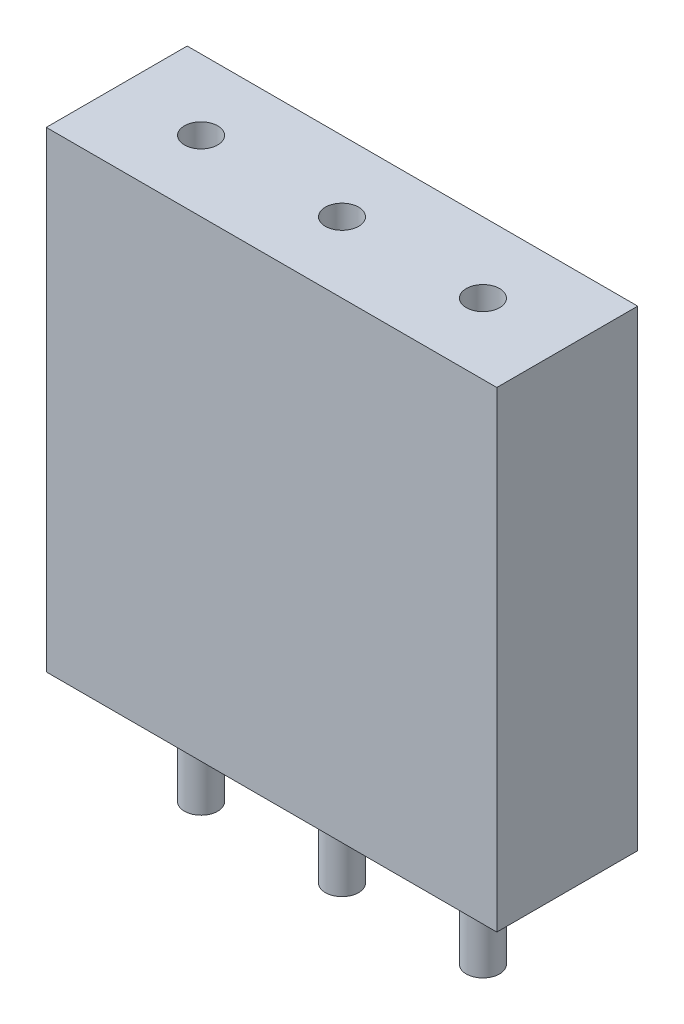
ISO-10303-21;
HEADER;
FILE_DESCRIPTION(('STEP AP214'),'2;1');
FILE_NAME('part.step','',(''),(''),'','','');
FILE_SCHEMA(('AUTOMOTIVE_DESIGN { 1 0 10303 214 1 1 1 1 }'));
ENDSEC;
DATA;
#1=APPLICATION_CONTEXT('core data for automotive mechanical design processes');
#2=APPLICATION_PROTOCOL_DEFINITION('international standard','automotive_design',2000,#1);
#3=PRODUCT_CONTEXT('',#1,'mechanical');
#4=PRODUCT('Part','Part','',(#3));
#5=PRODUCT_RELATED_PRODUCT_CATEGORY('part','',(#4));
#6=PRODUCT_DEFINITION_FORMATION('','',#4);
#7=PRODUCT_DEFINITION_CONTEXT('part definition',#1,'design');
#8=PRODUCT_DEFINITION('design','',#6,#7);
#9=PRODUCT_DEFINITION_SHAPE('','',#8);
#10=(LENGTH_UNIT() NAMED_UNIT(*) SI_UNIT(.MILLI.,.METRE.));
#11=(NAMED_UNIT(*) PLANE_ANGLE_UNIT() SI_UNIT($,.RADIAN.));
#12=(NAMED_UNIT(*) SI_UNIT($,.STERADIAN.) SOLID_ANGLE_UNIT());
#13=UNCERTAINTY_MEASURE_WITH_UNIT(LENGTH_MEASURE(1.E-05),#10,'distance_accuracy_value','');
#14=(GEOMETRIC_REPRESENTATION_CONTEXT(3) GLOBAL_UNCERTAINTY_ASSIGNED_CONTEXT((#13)) GLOBAL_UNIT_ASSIGNED_CONTEXT((#10,
#11,#12)) REPRESENTATION_CONTEXT('',''));
#15=CARTESIAN_POINT('',(0.,0.,0.));
#16=DIRECTION('',(0.,0.,1.));
#17=DIRECTION('',(1.,0.,0.));
#18=AXIS2_PLACEMENT_3D('',#15,#16,#17);
#19=CARTESIAN_POINT('',(2.53999999999998,-1.9,0.));
#20=DIRECTION('',(0.,1.,0.));
#21=DIRECTION('',(0.,0.,1.));
#22=AXIS2_PLACEMENT_3D('',#19,#20,#21);
#23=CYLINDRICAL_SURFACE('',#22,0.3);
#24=CARTESIAN_POINT('',(2.53999999999998,-1.9,0.));
#25=DIRECTION('',(0.,-1.,0.));
#26=DIRECTION('',(0.,0.,-1.));
#27=AXIS2_PLACEMENT_3D('',#24,#25,#26);
#28=CIRCLE('',#27,0.3);
#29=CARTESIAN_POINT('',(2.53999999999998,-1.9,-0.3));
#30=VERTEX_POINT('',#29);
#31=EDGE_CURVE('E11',#30,#30,#28,.T.);
#32=ORIENTED_EDGE('',*,*,#31,.F.);
#33=EDGE_LOOP('',(#32));
#34=FACE_BOUND('',#33,.T.);
#35=CARTESIAN_POINT('',(2.53999999999998,0.,0.));
#36=DIRECTION('',(0.,-1.,0.));
#37=DIRECTION('',(0.,0.,-1.));
#38=AXIS2_PLACEMENT_3D('',#35,#36,#37);
#39=CIRCLE('',#38,0.3);
#40=CARTESIAN_POINT('',(2.53999999999998,0.,-0.3));
#41=VERTEX_POINT('',#40);
#42=EDGE_CURVE('E45',#41,#41,#39,.T.);
#43=ORIENTED_EDGE('',*,*,#42,.T.);
#44=EDGE_LOOP('',(#43));
#45=FACE_BOUND('',#44,.T.);
#46=ADVANCED_FACE('F42',(#34,#45),#23,.T.);
#47=CARTESIAN_POINT('',(2.53999999999998,-1.9,0.));
#48=DIRECTION('',(0.,-1.,0.));
#49=DIRECTION('',(0.,0.,-1.));
#50=AXIS2_PLACEMENT_3D('',#47,#48,#49);
#51=PLANE('',#50);
#52=ORIENTED_EDGE('',*,*,#31,.T.);
#53=EDGE_LOOP('',(#52));
#54=FACE_BOUND('',#53,.T.);
#55=ADVANCED_FACE('F57',(#54),#51,.T.);
#56=CARTESIAN_POINT('',(2.53999999999998,0.,0.));
#57=DIRECTION('',(0.,-1.,0.));
#58=DIRECTION('',(0.,0.,-1.));
#59=AXIS2_PLACEMENT_3D('',#56,#57,#58);
#60=PLANE('',#59);
#61=ORIENTED_EDGE('',*,*,#42,.F.);
#62=EDGE_LOOP('',(#61));
#63=FACE_BOUND('',#62,.T.);
#64=ADVANCED_FACE('F55',(#63),#60,.F.);
#65=CLOSED_SHELL('',(#46,#55,#64));
#66=MANIFOLD_SOLID_BREP('B2',#65);
#67=CARTESIAN_POINT('',(0.,-1.9,0.));
#68=DIRECTION('',(0.,1.,0.));
#69=DIRECTION('',(0.,0.,1.));
#70=AXIS2_PLACEMENT_3D('',#67,#68,#69);
#71=CYLINDRICAL_SURFACE('',#70,0.3);
#72=CARTESIAN_POINT('',(0.,-1.9,0.));
#73=DIRECTION('',(0.,-1.,0.));
#74=DIRECTION('',(0.,0.,-1.));
#75=AXIS2_PLACEMENT_3D('',#72,#73,#74);
#76=CIRCLE('',#75,0.3);
#77=CARTESIAN_POINT('',(0.,-1.9,-0.3));
#78=VERTEX_POINT('',#77);
#79=EDGE_CURVE('E41',#78,#78,#76,.T.);
#80=ORIENTED_EDGE('',*,*,#79,.F.);
#81=EDGE_LOOP('',(#80));
#82=FACE_BOUND('',#81,.T.);
#83=CARTESIAN_POINT('',(0.,0.,0.));
#84=DIRECTION('',(0.,-1.,0.));
#85=DIRECTION('',(0.,0.,-1.));
#86=AXIS2_PLACEMENT_3D('',#83,#84,#85);
#87=CIRCLE('',#86,0.3);
#88=CARTESIAN_POINT('',(0.,0.,-0.3));
#89=VERTEX_POINT('',#88);
#90=EDGE_CURVE('E94',#89,#89,#87,.T.);
#91=ORIENTED_EDGE('',*,*,#90,.T.);
#92=EDGE_LOOP('',(#91));
#93=FACE_BOUND('',#92,.T.);
#94=ADVANCED_FACE('F91',(#82,#93),#71,.T.);
#95=CARTESIAN_POINT('',(0.,-1.9,0.));
#96=DIRECTION('',(0.,-1.,0.));
#97=DIRECTION('',(0.,0.,-1.));
#98=AXIS2_PLACEMENT_3D('',#95,#96,#97);
#99=PLANE('',#98);
#100=ORIENTED_EDGE('',*,*,#79,.T.);
#101=EDGE_LOOP('',(#100));
#102=FACE_BOUND('',#101,.T.);
#103=ADVANCED_FACE('F106',(#102),#99,.T.);
#104=CARTESIAN_POINT('',(0.,0.,0.));
#105=DIRECTION('',(0.,-1.,0.));
#106=DIRECTION('',(0.,0.,-1.));
#107=AXIS2_PLACEMENT_3D('',#104,#105,#106);
#108=PLANE('',#107);
#109=ORIENTED_EDGE('',*,*,#90,.F.);
#110=EDGE_LOOP('',(#109));
#111=FACE_BOUND('',#110,.T.);
#112=ADVANCED_FACE('F104',(#111),#108,.F.);
#113=CLOSED_SHELL('',(#94,#103,#112));
#114=MANIFOLD_SOLID_BREP('B6',#113);
#115=CARTESIAN_POINT('',(-2.54000000000002,-1.9,0.));
#116=DIRECTION('',(0.,1.,0.));
#117=DIRECTION('',(0.,0.,1.));
#118=AXIS2_PLACEMENT_3D('',#115,#116,#117);
#119=CYLINDRICAL_SURFACE('',#118,0.3);
#120=CARTESIAN_POINT('',(-2.54000000000002,-1.9,0.));
#121=DIRECTION('',(0.,-1.,0.));
#122=DIRECTION('',(0.,0.,-1.));
#123=AXIS2_PLACEMENT_3D('',#120,#121,#122);
#124=CIRCLE('',#123,0.3);
#125=CARTESIAN_POINT('',(-2.54000000000002,-1.9,-0.3));
#126=VERTEX_POINT('',#125);
#127=EDGE_CURVE('E90',#126,#126,#124,.T.);
#128=ORIENTED_EDGE('',*,*,#127,.F.);
#129=EDGE_LOOP('',(#128));
#130=FACE_BOUND('',#129,.T.);
#131=CARTESIAN_POINT('',(-2.54000000000002,0.,0.));
#132=DIRECTION('',(0.,-1.,0.));
#133=DIRECTION('',(0.,0.,-1.));
#134=AXIS2_PLACEMENT_3D('',#131,#132,#133);
#135=CIRCLE('',#134,0.3);
#136=CARTESIAN_POINT('',(-2.54000000000002,0.,-0.3));
#137=VERTEX_POINT('',#136);
#138=EDGE_CURVE('E144',#137,#137,#135,.T.);
#139=ORIENTED_EDGE('',*,*,#138,.T.);
#140=EDGE_LOOP('',(#139));
#141=FACE_BOUND('',#140,.T.);
#142=ADVANCED_FACE('F141',(#130,#141),#119,.T.);
#143=CARTESIAN_POINT('',(-2.54000000000002,-1.9,0.));
#144=DIRECTION('',(0.,-1.,0.));
#145=DIRECTION('',(0.,0.,-1.));
#146=AXIS2_PLACEMENT_3D('',#143,#144,#145);
#147=PLANE('',#146);
#148=ORIENTED_EDGE('',*,*,#127,.T.);
#149=EDGE_LOOP('',(#148));
#150=FACE_BOUND('',#149,.T.);
#151=ADVANCED_FACE('F156',(#150),#147,.T.);
#152=CARTESIAN_POINT('',(-2.54000000000002,0.,0.));
#153=DIRECTION('',(0.,-1.,0.));
#154=DIRECTION('',(0.,0.,-1.));
#155=AXIS2_PLACEMENT_3D('',#152,#153,#154);
#156=PLANE('',#155);
#157=ORIENTED_EDGE('',*,*,#138,.F.);
#158=EDGE_LOOP('',(#157));
#159=FACE_BOUND('',#158,.T.);
#160=ADVANCED_FACE('F154',(#159),#156,.F.);
#161=CLOSED_SHELL('',(#142,#151,#160));
#162=MANIFOLD_SOLID_BREP('B36',#161);
#163=CARTESIAN_POINT('',(4.06,8.5,-1.27));
#164=DIRECTION('',(-1.,0.,0.));
#165=DIRECTION('',(0.,0.,1.));
#166=AXIS2_PLACEMENT_3D('',#163,#164,#165);
#167=PLANE('',#166);
#168=DIRECTION('',(0.,0.,-1.));
#169=VECTOR('',#168,1.);
#170=CARTESIAN_POINT('',(4.06,0.,-1.27));
#171=LINE('',#170,#169);
#172=CARTESIAN_POINT('',(4.06,0.,1.27));
#173=VERTEX_POINT('',#172);
#174=CARTESIAN_POINT('',(4.06,0.,-1.27));
#175=VERTEX_POINT('',#174);
#176=EDGE_CURVE('E245',#173,#175,#171,.T.);
#177=ORIENTED_EDGE('',*,*,#176,.T.);
#178=DIRECTION('',(0.,-1.,0.));
#179=VECTOR('',#178,1.);
#180=CARTESIAN_POINT('',(4.06,8.5,-1.27));
#181=LINE('',#180,#179);
#182=CARTESIAN_POINT('',(4.06,8.5,-1.27));
#183=VERTEX_POINT('',#182);
#184=EDGE_CURVE('E139',#183,#175,#181,.T.);
#185=ORIENTED_EDGE('',*,*,#184,.F.);
#186=DIRECTION('',(0.,0.,-1.));
#187=VECTOR('',#186,1.);
#188=CARTESIAN_POINT('',(4.06,8.5,-1.27));
#189=LINE('',#188,#187);
#190=CARTESIAN_POINT('',(4.06,8.5,1.27));
#191=VERTEX_POINT('',#190);
#192=EDGE_CURVE('E233',#191,#183,#189,.T.);
#193=ORIENTED_EDGE('',*,*,#192,.F.);
#194=DIRECTION('',(0.,-1.,0.));
#195=VECTOR('',#194,1.);
#196=CARTESIAN_POINT('',(4.06,8.5,1.27));
#197=LINE('',#196,#195);
#198=EDGE_CURVE('E241',#191,#173,#197,.T.);
#199=ORIENTED_EDGE('',*,*,#198,.T.);
#200=EDGE_LOOP('',(#177,#185,#193,#199));
#201=FACE_BOUND('',#200,.T.);
#202=ADVANCED_FACE('F182',(#201),#167,.F.);
#203=CARTESIAN_POINT('',(-4.06,8.5,-1.27));
#204=DIRECTION('',(0.,0.,1.));
#205=DIRECTION('',(1.,0.,0.));
#206=AXIS2_PLACEMENT_3D('',#203,#204,#205);
#207=PLANE('',#206);
#208=DIRECTION('',(-1.,0.,0.));
#209=VECTOR('',#208,1.);
#210=CARTESIAN_POINT('',(-4.06,0.,-1.27));
#211=LINE('',#210,#209);
#212=CARTESIAN_POINT('',(-4.06,0.,-1.27));
#213=VERTEX_POINT('',#212);
#214=EDGE_CURVE('E237',#175,#213,#211,.T.);
#215=ORIENTED_EDGE('',*,*,#214,.T.);
#216=DIRECTION('',(0.,-1.,0.));
#217=VECTOR('',#216,1.);
#218=CARTESIAN_POINT('',(-4.06,8.5,-1.27));
#219=LINE('',#218,#217);
#220=CARTESIAN_POINT('',(-4.06,8.5,-1.27));
#221=VERTEX_POINT('',#220);
#222=EDGE_CURVE('E190',#221,#213,#219,.T.);
#223=ORIENTED_EDGE('',*,*,#222,.F.);
#224=DIRECTION('',(-1.,0.,0.));
#225=VECTOR('',#224,1.);
#226=CARTESIAN_POINT('',(-4.06,8.5,-1.27));
#227=LINE('',#226,#225);
#228=EDGE_CURVE('E228',#183,#221,#227,.T.);
#229=ORIENTED_EDGE('',*,*,#228,.F.);
#230=ORIENTED_EDGE('',*,*,#184,.T.);
#231=EDGE_LOOP('',(#215,#223,#229,#230));
#232=FACE_BOUND('',#231,.T.);
#233=ADVANCED_FACE('F236',(#232),#207,.F.);
#234=CARTESIAN_POINT('',(-4.06,8.5,-1.27));
#235=DIRECTION('',(1.,0.,0.));
#236=DIRECTION('',(0.,0.,-1.));
#237=AXIS2_PLACEMENT_3D('',#234,#235,#236);
#238=PLANE('',#237);
#239=DIRECTION('',(0.,0.,1.));
#240=VECTOR('',#239,1.);
#241=CARTESIAN_POINT('',(-4.06,0.,-1.27));
#242=LINE('',#241,#240);
#243=CARTESIAN_POINT('',(-4.06,0.,1.27));
#244=VERTEX_POINT('',#243);
#245=EDGE_CURVE('E215',#213,#244,#242,.T.);
#246=ORIENTED_EDGE('',*,*,#245,.T.);
#247=DIRECTION('',(0.,-1.,0.));
#248=VECTOR('',#247,1.);
#249=CARTESIAN_POINT('',(-4.06,8.5,1.27));
#250=LINE('',#249,#248);
#251=CARTESIAN_POINT('',(-4.06,8.5,1.27));
#252=VERTEX_POINT('',#251);
#253=EDGE_CURVE('E238',#252,#244,#250,.T.);
#254=ORIENTED_EDGE('',*,*,#253,.F.);
#255=DIRECTION('',(0.,0.,1.));
#256=VECTOR('',#255,1.);
#257=CARTESIAN_POINT('',(-4.06,8.5,-1.27));
#258=LINE('',#257,#256);
#259=EDGE_CURVE('E231',#221,#252,#258,.T.);
#260=ORIENTED_EDGE('',*,*,#259,.F.);
#261=ORIENTED_EDGE('',*,*,#222,.T.);
#262=EDGE_LOOP('',(#246,#254,#260,#261));
#263=FACE_BOUND('',#262,.T.);
#264=ADVANCED_FACE('F239',(#263),#238,.F.);
#265=CARTESIAN_POINT('',(-4.06,8.5,1.27));
#266=DIRECTION('',(0.,0.,-1.));
#267=DIRECTION('',(-1.,0.,0.));
#268=AXIS2_PLACEMENT_3D('',#265,#266,#267);
#269=PLANE('',#268);
#270=DIRECTION('',(1.,0.,0.));
#271=VECTOR('',#270,1.);
#272=CARTESIAN_POINT('',(-4.06,0.,1.27));
#273=LINE('',#272,#271);
#274=EDGE_CURVE('E221',#244,#173,#273,.T.);
#275=ORIENTED_EDGE('',*,*,#274,.T.);
#276=ORIENTED_EDGE('',*,*,#198,.F.);
#277=DIRECTION('',(1.,0.,0.));
#278=VECTOR('',#277,1.);
#279=CARTESIAN_POINT('',(-4.06,8.5,1.27));
#280=LINE('',#279,#278);
#281=EDGE_CURVE('E198',#252,#191,#280,.T.);
#282=ORIENTED_EDGE('',*,*,#281,.F.);
#283=ORIENTED_EDGE('',*,*,#253,.T.);
#284=EDGE_LOOP('',(#275,#276,#282,#283));
#285=FACE_BOUND('',#284,.T.);
#286=ADVANCED_FACE('F253',(#285),#269,.F.);
#287=CARTESIAN_POINT('',(0.,8.5,0.));
#288=DIRECTION('',(0.,1.,0.));
#289=DIRECTION('',(0.,0.,1.));
#290=AXIS2_PLACEMENT_3D('',#287,#288,#289);
#291=PLANE('',#290);
#292=CARTESIAN_POINT('',(2.53999999999998,8.5,0.));
#293=DIRECTION('',(0.,1.,0.));
#294=DIRECTION('',(0.,0.,1.));
#295=AXIS2_PLACEMENT_3D('',#292,#293,#294);
#296=CIRCLE('',#295,0.3);
#297=CARTESIAN_POINT('',(2.53999999999998,8.5,0.3));
#298=VERTEX_POINT('',#297);
#299=EDGE_CURVE('E271',#298,#298,#296,.T.);
#300=ORIENTED_EDGE('',*,*,#299,.F.);
#301=EDGE_LOOP('',(#300));
#302=FACE_BOUND('',#301,.T.);
#303=CARTESIAN_POINT('',(0.,8.5,0.));
#304=DIRECTION('',(0.,1.,0.));
#305=DIRECTION('',(0.,0.,1.));
#306=AXIS2_PLACEMENT_3D('',#303,#304,#305);
#307=CIRCLE('',#306,0.3);
#308=CARTESIAN_POINT('',(0.,8.5,0.3));
#309=VERTEX_POINT('',#308);
#310=EDGE_CURVE('E265',#309,#309,#307,.T.);
#311=ORIENTED_EDGE('',*,*,#310,.F.);
#312=EDGE_LOOP('',(#311));
#313=FACE_BOUND('',#312,.T.);
#314=CARTESIAN_POINT('',(-2.54000000000002,8.5,0.));
#315=DIRECTION('',(0.,1.,0.));
#316=DIRECTION('',(0.,0.,1.));
#317=AXIS2_PLACEMENT_3D('',#314,#315,#316);
#318=CIRCLE('',#317,0.3);
#319=CARTESIAN_POINT('',(-2.54000000000002,8.5,0.3));
#320=VERTEX_POINT('',#319);
#321=EDGE_CURVE('E259',#320,#320,#318,.T.);
#322=ORIENTED_EDGE('',*,*,#321,.F.);
#323=EDGE_LOOP('',(#322));
#324=FACE_BOUND('',#323,.T.);
#325=ORIENTED_EDGE('',*,*,#192,.T.);
#326=ORIENTED_EDGE('',*,*,#228,.T.);
#327=ORIENTED_EDGE('',*,*,#259,.T.);
#328=ORIENTED_EDGE('',*,*,#281,.T.);
#329=EDGE_LOOP('',(#325,#326,#327,#328));
#330=FACE_BOUND('',#329,.T.);
#331=ADVANCED_FACE('F229',(#302,#313,#324,#330),#291,.T.);
#332=CARTESIAN_POINT('',(0.,0.,0.));
#333=DIRECTION('',(0.,1.,0.));
#334=DIRECTION('',(0.,0.,1.));
#335=AXIS2_PLACEMENT_3D('',#332,#333,#334);
#336=PLANE('',#335);
#337=CARTESIAN_POINT('',(2.53999999999998,0.,0.));
#338=DIRECTION('',(0.,1.,0.));
#339=DIRECTION('',(0.,0.,1.));
#340=AXIS2_PLACEMENT_3D('',#337,#338,#339);
#341=CIRCLE('',#340,0.3);
#342=CARTESIAN_POINT('',(2.53999999999998,0.,0.3));
#343=VERTEX_POINT('',#342);
#344=EDGE_CURVE('E268',#343,#343,#341,.T.);
#345=ORIENTED_EDGE('',*,*,#344,.T.);
#346=EDGE_LOOP('',(#345));
#347=FACE_BOUND('',#346,.T.);
#348=CARTESIAN_POINT('',(0.,0.,0.));
#349=DIRECTION('',(0.,1.,0.));
#350=DIRECTION('',(0.,0.,1.));
#351=AXIS2_PLACEMENT_3D('',#348,#349,#350);
#352=CIRCLE('',#351,0.3);
#353=CARTESIAN_POINT('',(0.,0.,0.3));
#354=VERTEX_POINT('',#353);
#355=EDGE_CURVE('E262',#354,#354,#352,.T.);
#356=ORIENTED_EDGE('',*,*,#355,.T.);
#357=EDGE_LOOP('',(#356));
#358=FACE_BOUND('',#357,.T.);
#359=CARTESIAN_POINT('',(-2.54000000000002,0.,0.));
#360=DIRECTION('',(0.,1.,0.));
#361=DIRECTION('',(0.,0.,1.));
#362=AXIS2_PLACEMENT_3D('',#359,#360,#361);
#363=CIRCLE('',#362,0.3);
#364=CARTESIAN_POINT('',(-2.54000000000002,0.,0.3));
#365=VERTEX_POINT('',#364);
#366=EDGE_CURVE('E248',#365,#365,#363,.T.);
#367=ORIENTED_EDGE('',*,*,#366,.T.);
#368=EDGE_LOOP('',(#367));
#369=FACE_BOUND('',#368,.T.);
#370=ORIENTED_EDGE('',*,*,#176,.F.);
#371=ORIENTED_EDGE('',*,*,#274,.F.);
#372=ORIENTED_EDGE('',*,*,#245,.F.);
#373=ORIENTED_EDGE('',*,*,#214,.F.);
#374=EDGE_LOOP('',(#370,#371,#372,#373));
#375=FACE_BOUND('',#374,.T.);
#376=ADVANCED_FACE('F256',(#347,#358,#369,#375),#336,.F.);
#377=CARTESIAN_POINT('',(-2.54000000000002,0.,0.));
#378=DIRECTION('',(0.,1.,0.));
#379=DIRECTION('',(0.,0.,1.));
#380=AXIS2_PLACEMENT_3D('',#377,#378,#379);
#381=CYLINDRICAL_SURFACE('',#380,0.3);
#382=ORIENTED_EDGE('',*,*,#366,.F.);
#383=EDGE_LOOP('',(#382));
#384=FACE_BOUND('',#383,.T.);
#385=ORIENTED_EDGE('',*,*,#321,.T.);
#386=EDGE_LOOP('',(#385));
#387=FACE_BOUND('',#386,.T.);
#388=ADVANCED_FACE('F293',(#384,#387),#381,.F.);
#389=CARTESIAN_POINT('',(0.,0.,0.));
#390=DIRECTION('',(0.,1.,0.));
#391=DIRECTION('',(0.,0.,1.));
#392=AXIS2_PLACEMENT_3D('',#389,#390,#391);
#393=CYLINDRICAL_SURFACE('',#392,0.3);
#394=ORIENTED_EDGE('',*,*,#355,.F.);
#395=EDGE_LOOP('',(#394));
#396=FACE_BOUND('',#395,.T.);
#397=ORIENTED_EDGE('',*,*,#310,.T.);
#398=EDGE_LOOP('',(#397));
#399=FACE_BOUND('',#398,.T.);
#400=ADVANCED_FACE('F282',(#396,#399),#393,.F.);
#401=CARTESIAN_POINT('',(2.53999999999998,0.,0.));
#402=DIRECTION('',(0.,1.,0.));
#403=DIRECTION('',(0.,0.,1.));
#404=AXIS2_PLACEMENT_3D('',#401,#402,#403);
#405=CYLINDRICAL_SURFACE('',#404,0.3);
#406=ORIENTED_EDGE('',*,*,#344,.F.);
#407=EDGE_LOOP('',(#406));
#408=FACE_BOUND('',#407,.T.);
#409=ORIENTED_EDGE('',*,*,#299,.T.);
#410=EDGE_LOOP('',(#409));
#411=FACE_BOUND('',#410,.T.);
#412=ADVANCED_FACE('F279',(#408,#411),#405,.F.);
#413=CLOSED_SHELL('',(#202,#233,#264,#286,#331,#376,#388,#400,#412));
#414=MANIFOLD_SOLID_BREP('B85',#413);
#415=ADVANCED_BREP_SHAPE_REPRESENTATION('',(#18,#66,#114,#162,#414),#14);
#416=SHAPE_DEFINITION_REPRESENTATION(#9,#415);
ENDSEC;
END-ISO-10303-21;
